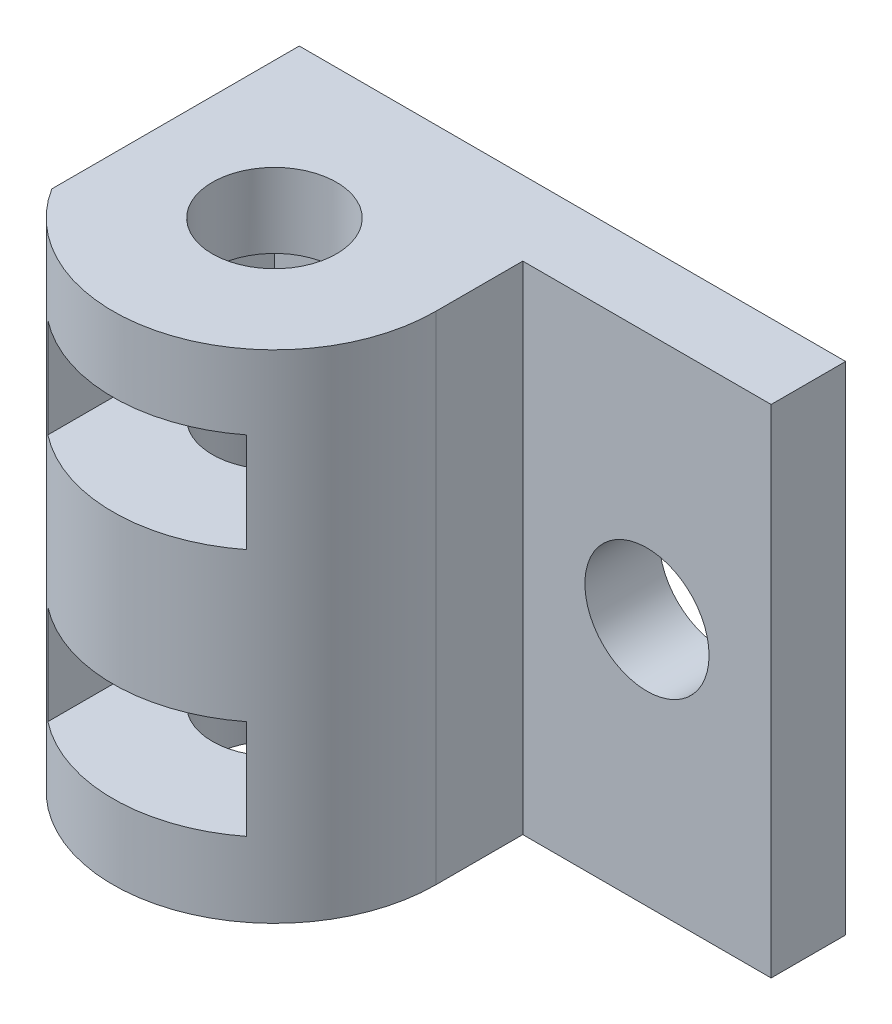
ISO-10303-21;
HEADER;
FILE_DESCRIPTION(('STEP AP214'),'2;1');
FILE_NAME('part.step','',(''),(''),'','','');
FILE_SCHEMA(('AUTOMOTIVE_DESIGN { 1 0 10303 214 1 1 1 1 }'));
ENDSEC;
DATA;
#1=APPLICATION_CONTEXT('core data for automotive mechanical design processes');
#2=APPLICATION_PROTOCOL_DEFINITION('international standard','automotive_design',2000,#1);
#3=PRODUCT_CONTEXT('',#1,'mechanical');
#4=PRODUCT('Part','Part','',(#3));
#5=PRODUCT_RELATED_PRODUCT_CATEGORY('part','',(#4));
#6=PRODUCT_DEFINITION_FORMATION('','',#4);
#7=PRODUCT_DEFINITION_CONTEXT('part definition',#1,'design');
#8=PRODUCT_DEFINITION('design','',#6,#7);
#9=PRODUCT_DEFINITION_SHAPE('','',#8);
#10=(LENGTH_UNIT() NAMED_UNIT(*) SI_UNIT(.MILLI.,.METRE.));
#11=(NAMED_UNIT(*) PLANE_ANGLE_UNIT() SI_UNIT($,.RADIAN.));
#12=(NAMED_UNIT(*) SI_UNIT($,.STERADIAN.) SOLID_ANGLE_UNIT());
#13=UNCERTAINTY_MEASURE_WITH_UNIT(LENGTH_MEASURE(1.E-05),#10,'distance_accuracy_value','');
#14=(GEOMETRIC_REPRESENTATION_CONTEXT(3) GLOBAL_UNCERTAINTY_ASSIGNED_CONTEXT((#13)) GLOBAL_UNIT_ASSIGNED_CONTEXT((#10,
#11,#12)) REPRESENTATION_CONTEXT('',''));
#15=CARTESIAN_POINT('',(0.,0.,0.));
#16=DIRECTION('',(0.,0.,1.));
#17=DIRECTION('',(1.,0.,0.));
#18=AXIS2_PLACEMENT_3D('',#15,#16,#17);
#19=CARTESIAN_POINT('',(-4.05947955390334,-14.7630111524164,6.5));
#20=DIRECTION('',(0.,1.,0.));
#21=DIRECTION('',(0.,0.,1.));
#22=AXIS2_PLACEMENT_3D('',#19,#20,#21);
#23=CYLINDRICAL_SURFACE('',#22,6.5);
#24=DIRECTION('',(0.,1.,0.));
#25=VECTOR('',#24,1.);
#26=CARTESIAN_POINT('',(-9.55947955390334,-14.7630111524164,9.96410161513776));
#27=LINE('',#26,#25);
#28=CARTESIAN_POINT('',(-9.55947955390334,-14.7630111524164,9.96410161513776));
#29=VERTEX_POINT('',#28);
#30=CARTESIAN_POINT('',(-9.55947955390334,5.23698884758364,9.96410161513776));
#31=VERTEX_POINT('',#30);
#32=EDGE_CURVE('E150',#29,#31,#27,.T.);
#33=ORIENTED_EDGE('',*,*,#32,.F.);
#34=CARTESIAN_POINT('',(-4.05947955390334,-14.7630111524164,6.5));
#35=DIRECTION('',(0.,1.,0.));
#36=DIRECTION('',(0.,0.,1.));
#37=AXIS2_PLACEMENT_3D('',#34,#35,#36);
#38=CIRCLE('',#37,6.5);
#39=CARTESIAN_POINT('',(2.44052044609666,-14.7630111524164,6.5));
#40=VERTEX_POINT('',#39);
#41=EDGE_CURVE('E159',#29,#40,#38,.T.);
#42=ORIENTED_EDGE('',*,*,#41,.T.);
#43=DIRECTION('',(0.,1.,0.));
#44=VECTOR('',#43,1.);
#45=CARTESIAN_POINT('',(2.44052044609666,-14.7630111524164,6.5));
#46=LINE('',#45,#44);
#47=CARTESIAN_POINT('',(2.44052044609666,5.23698884758364,6.5));
#48=VERTEX_POINT('',#47);
#49=EDGE_CURVE('E173',#40,#48,#46,.T.);
#50=ORIENTED_EDGE('',*,*,#49,.T.);
#51=CARTESIAN_POINT('',(-4.05947955390334,5.23698884758364,6.5));
#52=DIRECTION('',(0.,1.,0.));
#53=DIRECTION('',(0.,0.,1.));
#54=AXIS2_PLACEMENT_3D('',#51,#52,#53);
#55=CIRCLE('',#54,6.5);
#56=EDGE_CURVE('E295',#31,#48,#55,.T.);
#57=ORIENTED_EDGE('',*,*,#56,.F.);
#58=EDGE_LOOP('',(#33,#42,#50,#57));
#59=FACE_BOUND('',#58,.T.);
#60=DIRECTION('',(0.,1.,0.));
#61=VECTOR('',#60,1.);
#62=CARTESIAN_POINT('',(-8.05947955390335,-14.7630111524164,11.6234753829798));
#63=LINE('',#62,#61);
#64=CARTESIAN_POINT('',(-8.05947955390335,-1.76301115241636,11.6234753829798));
#65=VERTEX_POINT('',#64);
#66=CARTESIAN_POINT('',(-8.05947955390334,2.23698884758364,11.6234753829798));
#67=VERTEX_POINT('',#66);
#68=EDGE_CURVE('E189',#65,#67,#63,.T.);
#69=ORIENTED_EDGE('',*,*,#68,.T.);
#70=CARTESIAN_POINT('',(-4.05947955390334,2.23698884758364,6.5));
#71=DIRECTION('',(0.,-1.,0.));
#72=DIRECTION('',(0.,0.,-1.));
#73=AXIS2_PLACEMENT_3D('',#70,#71,#72);
#74=CIRCLE('',#73,6.5);
#75=CARTESIAN_POINT('',(-0.0594795539033436,2.23698884758364,11.6234753829798));
#76=VERTEX_POINT('',#75);
#77=EDGE_CURVE('E200',#67,#76,#74,.F.);
#78=ORIENTED_EDGE('',*,*,#77,.T.);
#79=DIRECTION('',(0.,1.,0.));
#80=VECTOR('',#79,1.);
#81=CARTESIAN_POINT('',(-0.0594795539033443,-14.7630111524164,11.6234753829798));
#82=LINE('',#81,#80);
#83=CARTESIAN_POINT('',(-0.0594795539033443,-1.76301115241636,11.6234753829798));
#84=VERTEX_POINT('',#83);
#85=EDGE_CURVE('E204',#84,#76,#82,.T.);
#86=ORIENTED_EDGE('',*,*,#85,.F.);
#87=CARTESIAN_POINT('',(-4.05947955390334,-1.76301115241636,6.5));
#88=DIRECTION('',(0.,-1.,0.));
#89=DIRECTION('',(0.,0.,-1.));
#90=AXIS2_PLACEMENT_3D('',#87,#88,#89);
#91=CIRCLE('',#90,6.5);
#92=EDGE_CURVE('E194',#65,#84,#91,.F.);
#93=ORIENTED_EDGE('',*,*,#92,.F.);
#94=EDGE_LOOP('',(#69,#78,#86,#93));
#95=FACE_BOUND('',#94,.T.);
#96=DIRECTION('',(0.,1.,0.));
#97=VECTOR('',#96,1.);
#98=CARTESIAN_POINT('',(-8.05947955390334,-14.7630111524164,11.6234753829798));
#99=LINE('',#98,#97);
#100=CARTESIAN_POINT('',(-8.05947955390334,-11.7630111524164,11.6234753829798));
#101=VERTEX_POINT('',#100);
#102=CARTESIAN_POINT('',(-8.05947955390334,-7.76301115241636,11.6234753829798));
#103=VERTEX_POINT('',#102);
#104=EDGE_CURVE('E51',#101,#103,#99,.T.);
#105=ORIENTED_EDGE('',*,*,#104,.T.);
#106=CARTESIAN_POINT('',(-4.05947955390334,-7.76301115241636,6.5));
#107=DIRECTION('',(0.,-1.,0.));
#108=DIRECTION('',(0.,0.,-1.));
#109=AXIS2_PLACEMENT_3D('',#106,#107,#108);
#110=CIRCLE('',#109,6.5);
#111=CARTESIAN_POINT('',(-0.0594795539033428,-7.76301115241636,11.6234753829798));
#112=VERTEX_POINT('',#111);
#113=EDGE_CURVE('E217',#103,#112,#110,.F.);
#114=ORIENTED_EDGE('',*,*,#113,.T.);
#115=DIRECTION('',(0.,1.,0.));
#116=VECTOR('',#115,1.);
#117=CARTESIAN_POINT('',(-0.0594795539033434,-14.7630111524164,11.6234753829798));
#118=LINE('',#117,#116);
#119=CARTESIAN_POINT('',(-0.0594795539033434,-11.7630111524164,11.6234753829798));
#120=VERTEX_POINT('',#119);
#121=EDGE_CURVE('E11',#120,#112,#118,.T.);
#122=ORIENTED_EDGE('',*,*,#121,.F.);
#123=CARTESIAN_POINT('',(-4.05947955390334,-11.7630111524164,6.5));
#124=DIRECTION('',(0.,-1.,0.));
#125=DIRECTION('',(0.,0.,-1.));
#126=AXIS2_PLACEMENT_3D('',#123,#124,#125);
#127=CIRCLE('',#126,6.5);
#128=EDGE_CURVE('E211',#101,#120,#127,.F.);
#129=ORIENTED_EDGE('',*,*,#128,.F.);
#130=EDGE_LOOP('',(#105,#114,#122,#129));
#131=FACE_BOUND('',#130,.T.);
#132=ADVANCED_FACE('F41',(#59,#95,#131),#23,.T.);
#133=CARTESIAN_POINT('',(-4.05947955390334,-14.7630111524164,6.5));
#134=DIRECTION('',(0.,1.,0.));
#135=DIRECTION('',(0.,0.,1.));
#136=AXIS2_PLACEMENT_3D('',#133,#134,#135);
#137=CYLINDRICAL_SURFACE('',#136,2.5);
#138=CARTESIAN_POINT('',(-4.05947955390334,-1.76301115241636,6.5));
#139=DIRECTION('',(0.,-1.,0.));
#140=DIRECTION('',(0.,0.,-1.));
#141=AXIS2_PLACEMENT_3D('',#138,#139,#140);
#142=CIRCLE('',#141,2.5);
#143=CARTESIAN_POINT('',(-4.05947955390334,-1.76301115241636,4.));
#144=VERTEX_POINT('',#143);
#145=EDGE_CURVE('E190',#144,#144,#142,.F.);
#146=ORIENTED_EDGE('',*,*,#145,.T.);
#147=EDGE_LOOP('',(#146));
#148=FACE_BOUND('',#147,.T.);
#149=CARTESIAN_POINT('',(-4.05947955390334,-7.76301115241636,6.5));
#150=DIRECTION('',(0.,-1.,0.));
#151=DIRECTION('',(0.,0.,-1.));
#152=AXIS2_PLACEMENT_3D('',#149,#150,#151);
#153=CIRCLE('',#152,2.5);
#154=CARTESIAN_POINT('',(-4.05947955390334,-7.76301115241636,4.));
#155=VERTEX_POINT('',#154);
#156=EDGE_CURVE('E213',#155,#155,#153,.F.);
#157=ORIENTED_EDGE('',*,*,#156,.F.);
#158=EDGE_LOOP('',(#157));
#159=FACE_BOUND('',#158,.T.);
#160=ADVANCED_FACE('F349',(#148,#159),#137,.F.);
#161=CARTESIAN_POINT('',(-4.05947955390334,5.23698884758364,6.5));
#162=DIRECTION('',(0.,1.,0.));
#163=DIRECTION('',(0.,0.,1.));
#164=AXIS2_PLACEMENT_3D('',#161,#162,#163);
#165=CIRCLE('',#164,2.5);
#166=CARTESIAN_POINT('',(-4.05947955390334,5.23698884758364,9.));
#167=VERTEX_POINT('',#166);
#168=EDGE_CURVE('E299',#167,#167,#165,.T.);
#169=ORIENTED_EDGE('',*,*,#168,.T.);
#170=EDGE_LOOP('',(#169));
#171=FACE_BOUND('',#170,.T.);
#172=CARTESIAN_POINT('',(-4.05947955390334,2.23698884758364,6.5));
#173=DIRECTION('',(0.,-1.,0.));
#174=DIRECTION('',(0.,0.,-1.));
#175=AXIS2_PLACEMENT_3D('',#172,#173,#174);
#176=CIRCLE('',#175,2.5);
#177=CARTESIAN_POINT('',(-4.05947955390334,2.23698884758364,4.));
#178=VERTEX_POINT('',#177);
#179=EDGE_CURVE('E196',#178,#178,#176,.F.);
#180=ORIENTED_EDGE('',*,*,#179,.F.);
#181=EDGE_LOOP('',(#180));
#182=FACE_BOUND('',#181,.T.);
#183=ADVANCED_FACE('F347',(#171,#182),#137,.F.);
#184=CARTESIAN_POINT('',(-10.5594795539033,-14.7630111524164,3.));
#185=DIRECTION('',(0.,1.,0.));
#186=DIRECTION('',(0.,0.,1.));
#187=AXIS2_PLACEMENT_3D('',#184,#185,#186);
#188=PLANE('',#187);
#189=ORIENTED_EDGE('',*,*,#41,.F.);
#190=DIRECTION('',(0.,0.,1.));
#191=VECTOR('',#190,1.);
#192=CARTESIAN_POINT('',(-9.55947955390334,-14.7630111524164,0.));
#193=LINE('',#192,#191);
#194=CARTESIAN_POINT('',(-9.55947955390334,-14.7630111524164,0.));
#195=VERTEX_POINT('',#194);
#196=EDGE_CURVE('E143',#195,#29,#193,.T.);
#197=ORIENTED_EDGE('',*,*,#196,.F.);
#198=DIRECTION('',(1.,0.,0.));
#199=VECTOR('',#198,1.);
#200=CARTESIAN_POINT('',(-10.5594795539033,-14.7630111524164,0.));
#201=LINE('',#200,#199);
#202=CARTESIAN_POINT('',(12.4405204460967,-14.7630111524164,0.));
#203=VERTEX_POINT('',#202);
#204=EDGE_CURVE('E156',#195,#203,#201,.T.);
#205=ORIENTED_EDGE('',*,*,#204,.T.);
#206=DIRECTION('',(0.,0.,-1.));
#207=VECTOR('',#206,1.);
#208=CARTESIAN_POINT('',(12.4405204460967,-14.7630111524164,3.));
#209=LINE('',#208,#207);
#210=CARTESIAN_POINT('',(12.4405204460967,-14.7630111524164,3.));
#211=VERTEX_POINT('',#210);
#212=EDGE_CURVE('E186',#211,#203,#209,.T.);
#213=ORIENTED_EDGE('',*,*,#212,.F.);
#214=DIRECTION('',(1.,0.,0.));
#215=VECTOR('',#214,1.);
#216=CARTESIAN_POINT('',(-10.5594795539033,-14.7630111524164,3.));
#217=LINE('',#216,#215);
#218=CARTESIAN_POINT('',(2.44052044609666,-14.7630111524164,3.));
#219=VERTEX_POINT('',#218);
#220=EDGE_CURVE('E181',#219,#211,#217,.T.);
#221=ORIENTED_EDGE('',*,*,#220,.F.);
#222=DIRECTION('',(0.,0.,-1.));
#223=VECTOR('',#222,1.);
#224=CARTESIAN_POINT('',(2.44052044609666,-14.7630111524164,0.));
#225=LINE('',#224,#223);
#226=EDGE_CURVE('E298',#40,#219,#225,.T.);
#227=ORIENTED_EDGE('',*,*,#226,.F.);
#228=EDGE_LOOP('',(#189,#197,#205,#213,#221,#227));
#229=FACE_BOUND('',#228,.T.);
#230=CARTESIAN_POINT('',(-4.05947955390334,-14.7630111524164,6.5));
#231=DIRECTION('',(0.,1.,0.));
#232=DIRECTION('',(0.,0.,1.));
#233=AXIS2_PLACEMENT_3D('',#230,#231,#232);
#234=CIRCLE('',#233,2.5);
#235=CARTESIAN_POINT('',(-4.05947955390334,-14.7630111524164,9.));
#236=VERTEX_POINT('',#235);
#237=EDGE_CURVE('E303',#236,#236,#234,.T.);
#238=ORIENTED_EDGE('',*,*,#237,.T.);
#239=EDGE_LOOP('',(#238));
#240=FACE_BOUND('',#239,.T.);
#241=ADVANCED_FACE('F43',(#229,#240),#188,.F.);
#242=CARTESIAN_POINT('',(12.4405204460967,5.23698884758364,3.));
#243=DIRECTION('',(-1.,0.,0.));
#244=DIRECTION('',(0.,-1.,0.));
#245=AXIS2_PLACEMENT_3D('',#242,#243,#244);
#246=PLANE('',#245);
#247=DIRECTION('',(0.,1.,0.));
#248=VECTOR('',#247,1.);
#249=CARTESIAN_POINT('',(12.4405204460967,5.23698884758364,0.));
#250=LINE('',#249,#248);
#251=CARTESIAN_POINT('',(12.4405204460967,5.23698884758364,0.));
#252=VERTEX_POINT('',#251);
#253=EDGE_CURVE('E164',#203,#252,#250,.T.);
#254=ORIENTED_EDGE('',*,*,#253,.T.);
#255=DIRECTION('',(0.,0.,-1.));
#256=VECTOR('',#255,1.);
#257=CARTESIAN_POINT('',(12.4405204460967,5.23698884758364,3.));
#258=LINE('',#257,#256);
#259=CARTESIAN_POINT('',(12.4405204460967,5.23698884758364,3.));
#260=VERTEX_POINT('',#259);
#261=EDGE_CURVE('E182',#260,#252,#258,.T.);
#262=ORIENTED_EDGE('',*,*,#261,.F.);
#263=DIRECTION('',(0.,1.,0.));
#264=VECTOR('',#263,1.);
#265=CARTESIAN_POINT('',(12.4405204460967,5.23698884758364,3.));
#266=LINE('',#265,#264);
#267=EDGE_CURVE('E320',#211,#260,#266,.T.);
#268=ORIENTED_EDGE('',*,*,#267,.F.);
#269=ORIENTED_EDGE('',*,*,#212,.T.);
#270=EDGE_LOOP('',(#254,#262,#268,#269));
#271=FACE_BOUND('',#270,.T.);
#272=ADVANCED_FACE('F340',(#271),#246,.F.);
#273=CARTESIAN_POINT('',(-10.5594795539033,5.23698884758364,3.));
#274=DIRECTION('',(0.,-1.,0.));
#275=DIRECTION('',(0.,0.,-1.));
#276=AXIS2_PLACEMENT_3D('',#273,#274,#275);
#277=PLANE('',#276);
#278=DIRECTION('',(-1.,0.,0.));
#279=VECTOR('',#278,1.);
#280=CARTESIAN_POINT('',(-10.5594795539033,5.23698884758364,0.));
#281=LINE('',#280,#279);
#282=CARTESIAN_POINT('',(-9.55947955390334,5.23698884758364,0.));
#283=VERTEX_POINT('',#282);
#284=EDGE_CURVE('E170',#252,#283,#281,.T.);
#285=ORIENTED_EDGE('',*,*,#284,.T.);
#286=DIRECTION('',(0.,0.,1.));
#287=VECTOR('',#286,1.);
#288=CARTESIAN_POINT('',(-9.55947955390334,5.23698884758364,0.));
#289=LINE('',#288,#287);
#290=EDGE_CURVE('E58',#283,#31,#289,.T.);
#291=ORIENTED_EDGE('',*,*,#290,.T.);
#292=ORIENTED_EDGE('',*,*,#56,.T.);
#293=DIRECTION('',(0.,0.,-1.));
#294=VECTOR('',#293,1.);
#295=CARTESIAN_POINT('',(2.44052044609666,5.23698884758364,0.));
#296=LINE('',#295,#294);
#297=CARTESIAN_POINT('',(2.44052044609666,5.23698884758364,3.));
#298=VERTEX_POINT('',#297);
#299=EDGE_CURVE('E309',#48,#298,#296,.T.);
#300=ORIENTED_EDGE('',*,*,#299,.T.);
#301=DIRECTION('',(-1.,0.,0.));
#302=VECTOR('',#301,1.);
#303=CARTESIAN_POINT('',(-10.5594795539033,5.23698884758364,3.));
#304=LINE('',#303,#302);
#305=EDGE_CURVE('E176',#260,#298,#304,.T.);
#306=ORIENTED_EDGE('',*,*,#305,.F.);
#307=ORIENTED_EDGE('',*,*,#261,.T.);
#308=EDGE_LOOP('',(#285,#291,#292,#300,#306,#307));
#309=FACE_BOUND('',#308,.T.);
#310=ORIENTED_EDGE('',*,*,#168,.F.);
#311=EDGE_LOOP('',(#310));
#312=FACE_BOUND('',#311,.T.);
#313=ADVANCED_FACE('F334',(#309,#312),#277,.F.);
#314=CARTESIAN_POINT('',(0.,0.,3.));
#315=DIRECTION('',(0.,0.,1.));
#316=DIRECTION('',(1.,0.,0.));
#317=AXIS2_PLACEMENT_3D('',#314,#315,#316);
#318=PLANE('',#317);
#319=CARTESIAN_POINT('',(7.44052044609666,-4.76301115241636,3.));
#320=DIRECTION('',(0.,0.,1.));
#321=DIRECTION('',(1.,0.,0.));
#322=AXIS2_PLACEMENT_3D('',#319,#320,#321);
#323=CIRCLE('',#322,2.5);
#324=CARTESIAN_POINT('',(9.94052044609666,-4.76301115241636,3.));
#325=VERTEX_POINT('',#324);
#326=EDGE_CURVE('E371',#325,#325,#323,.T.);
#327=ORIENTED_EDGE('',*,*,#326,.F.);
#328=EDGE_LOOP('',(#327));
#329=FACE_BOUND('',#328,.T.);
#330=DIRECTION('',(0.,1.,0.));
#331=VECTOR('',#330,1.);
#332=CARTESIAN_POINT('',(2.44052044609666,-14.7630111524164,3.));
#333=LINE('',#332,#331);
#334=EDGE_CURVE('E166',#219,#298,#333,.T.);
#335=ORIENTED_EDGE('',*,*,#334,.F.);
#336=ORIENTED_EDGE('',*,*,#220,.T.);
#337=ORIENTED_EDGE('',*,*,#267,.T.);
#338=ORIENTED_EDGE('',*,*,#305,.T.);
#339=EDGE_LOOP('',(#335,#336,#337,#338));
#340=FACE_BOUND('',#339,.T.);
#341=ADVANCED_FACE('F327',(#329,#340),#318,.T.);
#342=CARTESIAN_POINT('',(0.,0.,0.));
#343=DIRECTION('',(0.,0.,1.));
#344=DIRECTION('',(1.,0.,0.));
#345=AXIS2_PLACEMENT_3D('',#342,#343,#344);
#346=PLANE('',#345);
#347=CARTESIAN_POINT('',(7.44052044609666,-4.76301115241636,0.));
#348=DIRECTION('',(0.,0.,1.));
#349=DIRECTION('',(1.,0.,0.));
#350=AXIS2_PLACEMENT_3D('',#347,#348,#349);
#351=CIRCLE('',#350,2.5);
#352=CARTESIAN_POINT('',(9.94052044609666,-4.76301115241636,0.));
#353=VERTEX_POINT('',#352);
#354=EDGE_CURVE('E45',#353,#353,#351,.T.);
#355=ORIENTED_EDGE('',*,*,#354,.T.);
#356=EDGE_LOOP('',(#355));
#357=FACE_BOUND('',#356,.T.);
#358=ORIENTED_EDGE('',*,*,#204,.F.);
#359=DIRECTION('',(0.,-1.,0.));
#360=VECTOR('',#359,1.);
#361=CARTESIAN_POINT('',(-9.55947955390334,5.23698884758364,0.));
#362=LINE('',#361,#360);
#363=EDGE_CURVE('E140',#283,#195,#362,.T.);
#364=ORIENTED_EDGE('',*,*,#363,.F.);
#365=ORIENTED_EDGE('',*,*,#284,.F.);
#366=ORIENTED_EDGE('',*,*,#253,.F.);
#367=EDGE_LOOP('',(#358,#364,#365,#366));
#368=FACE_BOUND('',#367,.T.);
#369=ADVANCED_FACE('F163',(#357,#368),#346,.F.);
#370=CARTESIAN_POINT('',(2.44052044609666,-14.7630111524164,0.));
#371=DIRECTION('',(1.,0.,0.));
#372=DIRECTION('',(0.,0.,-1.));
#373=AXIS2_PLACEMENT_3D('',#370,#371,#372);
#374=PLANE('',#373);
#375=ORIENTED_EDGE('',*,*,#299,.F.);
#376=ORIENTED_EDGE('',*,*,#49,.F.);
#377=ORIENTED_EDGE('',*,*,#226,.T.);
#378=ORIENTED_EDGE('',*,*,#334,.T.);
#379=EDGE_LOOP('',(#375,#376,#377,#378));
#380=FACE_BOUND('',#379,.T.);
#381=ADVANCED_FACE('F332',(#380),#374,.T.);
#382=CARTESIAN_POINT('',(-4.05947955390334,-11.7630111524164,6.5));
#383=DIRECTION('',(0.,-1.,0.));
#384=DIRECTION('',(0.,0.,-1.));
#385=AXIS2_PLACEMENT_3D('',#382,#383,#384);
#386=CIRCLE('',#385,2.5);
#387=CARTESIAN_POINT('',(-4.05947955390334,-11.7630111524164,4.));
#388=VERTEX_POINT('',#387);
#389=EDGE_CURVE('E207',#388,#388,#386,.F.);
#390=ORIENTED_EDGE('',*,*,#389,.T.);
#391=EDGE_LOOP('',(#390));
#392=FACE_BOUND('',#391,.T.);
#393=ORIENTED_EDGE('',*,*,#237,.F.);
#394=EDGE_LOOP('',(#393));
#395=FACE_BOUND('',#394,.T.);
#396=ADVANCED_FACE('F356',(#392,#395),#137,.F.);
#397=CARTESIAN_POINT('',(0.,2.23698884758364,0.));
#398=DIRECTION('',(0.,-1.,0.));
#399=DIRECTION('',(0.,0.,-1.));
#400=AXIS2_PLACEMENT_3D('',#397,#398,#399);
#401=PLANE('',#400);
#402=DIRECTION('',(0.,0.,1.));
#403=VECTOR('',#402,1.);
#404=CARTESIAN_POINT('',(-8.05947955390334,2.23698884758364,10.5));
#405=LINE('',#404,#403);
#406=CARTESIAN_POINT('',(-8.05947955390334,2.23698884758364,2.5));
#407=VERTEX_POINT('',#406);
#408=EDGE_CURVE('E267',#407,#67,#405,.T.);
#409=ORIENTED_EDGE('',*,*,#408,.F.);
#410=DIRECTION('',(-1.,0.,0.));
#411=VECTOR('',#410,1.);
#412=CARTESIAN_POINT('',(-0.0594795539033428,2.23698884758364,2.5));
#413=LINE('',#412,#411);
#414=CARTESIAN_POINT('',(-0.0594795539033428,2.23698884758364,2.5));
#415=VERTEX_POINT('',#414);
#416=EDGE_CURVE('E272',#415,#407,#413,.T.);
#417=ORIENTED_EDGE('',*,*,#416,.F.);
#418=DIRECTION('',(0.,0.,1.));
#419=VECTOR('',#418,1.);
#420=CARTESIAN_POINT('',(-0.0594795539033437,2.23698884758364,10.5));
#421=LINE('',#420,#419);
#422=EDGE_CURVE('E263',#415,#76,#421,.T.);
#423=ORIENTED_EDGE('',*,*,#422,.T.);
#424=ORIENTED_EDGE('',*,*,#77,.F.);
#425=EDGE_LOOP('',(#409,#417,#423,#424));
#426=FACE_BOUND('',#425,.T.);
#427=ORIENTED_EDGE('',*,*,#179,.T.);
#428=EDGE_LOOP('',(#427));
#429=FACE_BOUND('',#428,.T.);
#430=ADVANCED_FACE('F405',(#426,#429),#401,.T.);
#431=CARTESIAN_POINT('',(0.,-1.76301115241636,0.));
#432=DIRECTION('',(0.,-1.,0.));
#433=DIRECTION('',(0.,0.,-1.));
#434=AXIS2_PLACEMENT_3D('',#431,#432,#433);
#435=PLANE('',#434);
#436=ORIENTED_EDGE('',*,*,#92,.T.);
#437=DIRECTION('',(0.,0.,1.));
#438=VECTOR('',#437,1.);
#439=CARTESIAN_POINT('',(-0.0594795539033428,-1.76301115241636,2.5));
#440=LINE('',#439,#438);
#441=CARTESIAN_POINT('',(-0.0594795539033428,-1.76301115241636,2.5));
#442=VERTEX_POINT('',#441);
#443=EDGE_CURVE('E268',#442,#84,#440,.T.);
#444=ORIENTED_EDGE('',*,*,#443,.F.);
#445=DIRECTION('',(-1.,0.,0.));
#446=VECTOR('',#445,1.);
#447=CARTESIAN_POINT('',(-0.0594795539033428,-1.76301115241636,2.5));
#448=LINE('',#447,#446);
#449=CARTESIAN_POINT('',(-8.05947955390334,-1.76301115241636,2.5));
#450=VERTEX_POINT('',#449);
#451=EDGE_CURVE('E279',#442,#450,#448,.T.);
#452=ORIENTED_EDGE('',*,*,#451,.T.);
#453=DIRECTION('',(0.,0.,1.));
#454=VECTOR('',#453,1.);
#455=CARTESIAN_POINT('',(-8.05947955390334,-1.76301115241636,2.5));
#456=LINE('',#455,#454);
#457=EDGE_CURVE('E262',#450,#65,#456,.T.);
#458=ORIENTED_EDGE('',*,*,#457,.T.);
#459=EDGE_LOOP('',(#436,#444,#452,#458));
#460=FACE_BOUND('',#459,.T.);
#461=ORIENTED_EDGE('',*,*,#145,.F.);
#462=EDGE_LOOP('',(#461));
#463=FACE_BOUND('',#462,.T.);
#464=ADVANCED_FACE('F408',(#460,#463),#435,.F.);
#465=CARTESIAN_POINT('',(-0.0594795539033428,2.23698884758364,2.5));
#466=DIRECTION('',(1.,0.,0.));
#467=DIRECTION('',(0.,0.,-1.));
#468=AXIS2_PLACEMENT_3D('',#465,#466,#467);
#469=PLANE('',#468);
#470=ORIENTED_EDGE('',*,*,#85,.T.);
#471=ORIENTED_EDGE('',*,*,#422,.F.);
#472=DIRECTION('',(0.,-1.,0.));
#473=VECTOR('',#472,1.);
#474=CARTESIAN_POINT('',(-0.0594795539033428,2.23698884758364,2.5));
#475=LINE('',#474,#473);
#476=EDGE_CURVE('E195',#415,#442,#475,.T.);
#477=ORIENTED_EDGE('',*,*,#476,.T.);
#478=ORIENTED_EDGE('',*,*,#443,.T.);
#479=EDGE_LOOP('',(#470,#471,#477,#478));
#480=FACE_BOUND('',#479,.T.);
#481=ADVANCED_FACE('F412',(#480),#469,.F.);
#482=CARTESIAN_POINT('',(-0.0594795539033428,2.23698884758364,2.5));
#483=DIRECTION('',(0.,0.,1.));
#484=DIRECTION('',(1.,0.,0.));
#485=AXIS2_PLACEMENT_3D('',#482,#483,#484);
#486=PLANE('',#485);
#487=ORIENTED_EDGE('',*,*,#451,.F.);
#488=ORIENTED_EDGE('',*,*,#476,.F.);
#489=ORIENTED_EDGE('',*,*,#416,.T.);
#490=DIRECTION('',(0.,-1.,0.));
#491=VECTOR('',#490,1.);
#492=CARTESIAN_POINT('',(-8.05947955390334,2.23698884758364,2.5));
#493=LINE('',#492,#491);
#494=EDGE_CURVE('E276',#407,#450,#493,.T.);
#495=ORIENTED_EDGE('',*,*,#494,.T.);
#496=EDGE_LOOP('',(#487,#488,#489,#495));
#497=FACE_BOUND('',#496,.T.);
#498=ADVANCED_FACE('F416',(#497),#486,.T.);
#499=CARTESIAN_POINT('',(-8.05947955390334,2.23698884758364,2.5));
#500=DIRECTION('',(1.,0.,0.));
#501=DIRECTION('',(0.,0.,-1.));
#502=AXIS2_PLACEMENT_3D('',#499,#500,#501);
#503=PLANE('',#502);
#504=ORIENTED_EDGE('',*,*,#457,.F.);
#505=ORIENTED_EDGE('',*,*,#494,.F.);
#506=ORIENTED_EDGE('',*,*,#408,.T.);
#507=ORIENTED_EDGE('',*,*,#68,.F.);
#508=EDGE_LOOP('',(#504,#505,#506,#507));
#509=FACE_BOUND('',#508,.T.);
#510=ADVANCED_FACE('F395',(#509),#503,.T.);
#511=CARTESIAN_POINT('',(0.,-7.76301115241636,0.));
#512=DIRECTION('',(0.,-1.,0.));
#513=DIRECTION('',(0.,0.,-1.));
#514=AXIS2_PLACEMENT_3D('',#511,#512,#513);
#515=PLANE('',#514);
#516=DIRECTION('',(0.,0.,1.));
#517=VECTOR('',#516,1.);
#518=CARTESIAN_POINT('',(-8.05947955390334,-7.76301115241636,10.5));
#519=LINE('',#518,#517);
#520=CARTESIAN_POINT('',(-8.05947955390334,-7.76301115241636,2.5));
#521=VERTEX_POINT('',#520);
#522=EDGE_CURVE('E228',#521,#103,#519,.T.);
#523=ORIENTED_EDGE('',*,*,#522,.F.);
#524=DIRECTION('',(-1.,0.,0.));
#525=VECTOR('',#524,1.);
#526=CARTESIAN_POINT('',(-0.0594795539033419,-7.76301115241636,2.5));
#527=LINE('',#526,#525);
#528=CARTESIAN_POINT('',(-0.0594795539033419,-7.76301115241636,2.5));
#529=VERTEX_POINT('',#528);
#530=EDGE_CURVE('E235',#529,#521,#527,.T.);
#531=ORIENTED_EDGE('',*,*,#530,.F.);
#532=DIRECTION('',(0.,0.,1.));
#533=VECTOR('',#532,1.);
#534=CARTESIAN_POINT('',(-0.0594795539033429,-7.76301115241636,10.5));
#535=LINE('',#534,#533);
#536=EDGE_CURVE('E236',#529,#112,#535,.T.);
#537=ORIENTED_EDGE('',*,*,#536,.T.);
#538=ORIENTED_EDGE('',*,*,#113,.F.);
#539=EDGE_LOOP('',(#523,#531,#537,#538));
#540=FACE_BOUND('',#539,.T.);
#541=ORIENTED_EDGE('',*,*,#156,.T.);
#542=EDGE_LOOP('',(#541));
#543=FACE_BOUND('',#542,.T.);
#544=ADVANCED_FACE('F391',(#540,#543),#515,.T.);
#545=CARTESIAN_POINT('',(0.,-11.7630111524164,0.));
#546=DIRECTION('',(0.,-1.,0.));
#547=DIRECTION('',(0.,0.,-1.));
#548=AXIS2_PLACEMENT_3D('',#545,#546,#547);
#549=PLANE('',#548);
#550=ORIENTED_EDGE('',*,*,#128,.T.);
#551=DIRECTION('',(0.,0.,1.));
#552=VECTOR('',#551,1.);
#553=CARTESIAN_POINT('',(-0.0594795539033419,-11.7630111524164,2.5));
#554=LINE('',#553,#552);
#555=CARTESIAN_POINT('',(-0.0594795539033419,-11.7630111524164,2.5));
#556=VERTEX_POINT('',#555);
#557=EDGE_CURVE('E242',#556,#120,#554,.T.);
#558=ORIENTED_EDGE('',*,*,#557,.F.);
#559=DIRECTION('',(-1.,0.,0.));
#560=VECTOR('',#559,1.);
#561=CARTESIAN_POINT('',(-0.0594795539033419,-11.7630111524164,2.5));
#562=LINE('',#561,#560);
#563=CARTESIAN_POINT('',(-8.05947955390334,-11.7630111524164,2.5));
#564=VERTEX_POINT('',#563);
#565=EDGE_CURVE('E248',#556,#564,#562,.T.);
#566=ORIENTED_EDGE('',*,*,#565,.T.);
#567=DIRECTION('',(0.,0.,1.));
#568=VECTOR('',#567,1.);
#569=CARTESIAN_POINT('',(-8.05947955390334,-11.7630111524164,2.5));
#570=LINE('',#569,#568);
#571=EDGE_CURVE('E66',#564,#101,#570,.T.);
#572=ORIENTED_EDGE('',*,*,#571,.T.);
#573=EDGE_LOOP('',(#550,#558,#566,#572));
#574=FACE_BOUND('',#573,.T.);
#575=ORIENTED_EDGE('',*,*,#389,.F.);
#576=EDGE_LOOP('',(#575));
#577=FACE_BOUND('',#576,.T.);
#578=ADVANCED_FACE('F394',(#574,#577),#549,.F.);
#579=CARTESIAN_POINT('',(-0.0594795539033419,-7.76301115241636,2.5));
#580=DIRECTION('',(1.,0.,0.));
#581=DIRECTION('',(0.,0.,-1.));
#582=AXIS2_PLACEMENT_3D('',#579,#580,#581);
#583=PLANE('',#582);
#584=ORIENTED_EDGE('',*,*,#121,.T.);
#585=ORIENTED_EDGE('',*,*,#536,.F.);
#586=DIRECTION('',(0.,-1.,0.));
#587=VECTOR('',#586,1.);
#588=CARTESIAN_POINT('',(-0.0594795539033419,-7.76301115241636,2.5));
#589=LINE('',#588,#587);
#590=EDGE_CURVE('E212',#529,#556,#589,.T.);
#591=ORIENTED_EDGE('',*,*,#590,.T.);
#592=ORIENTED_EDGE('',*,*,#557,.T.);
#593=EDGE_LOOP('',(#584,#585,#591,#592));
#594=FACE_BOUND('',#593,.T.);
#595=ADVANCED_FACE('F398',(#594),#583,.F.);
#596=CARTESIAN_POINT('',(-0.0594795539033419,-7.76301115241636,2.5));
#597=DIRECTION('',(0.,0.,1.));
#598=DIRECTION('',(1.,0.,0.));
#599=AXIS2_PLACEMENT_3D('',#596,#597,#598);
#600=PLANE('',#599);
#601=ORIENTED_EDGE('',*,*,#565,.F.);
#602=ORIENTED_EDGE('',*,*,#590,.F.);
#603=ORIENTED_EDGE('',*,*,#530,.T.);
#604=DIRECTION('',(0.,-1.,0.));
#605=VECTOR('',#604,1.);
#606=CARTESIAN_POINT('',(-8.05947955390334,-7.76301115241636,2.5));
#607=LINE('',#606,#605);
#608=EDGE_CURVE('E230',#521,#564,#607,.T.);
#609=ORIENTED_EDGE('',*,*,#608,.T.);
#610=EDGE_LOOP('',(#601,#602,#603,#609));
#611=FACE_BOUND('',#610,.T.);
#612=ADVANCED_FACE('F388',(#611),#600,.T.);
#613=CARTESIAN_POINT('',(-8.05947955390334,-7.76301115241636,2.5));
#614=DIRECTION('',(1.,0.,0.));
#615=DIRECTION('',(0.,0.,-1.));
#616=AXIS2_PLACEMENT_3D('',#613,#614,#615);
#617=PLANE('',#616);
#618=ORIENTED_EDGE('',*,*,#571,.F.);
#619=ORIENTED_EDGE('',*,*,#608,.F.);
#620=ORIENTED_EDGE('',*,*,#522,.T.);
#621=ORIENTED_EDGE('',*,*,#104,.F.);
#622=EDGE_LOOP('',(#618,#619,#620,#621));
#623=FACE_BOUND('',#622,.T.);
#624=ADVANCED_FACE('F226',(#623),#617,.T.);
#625=CARTESIAN_POINT('',(7.44052044609666,-4.76301115241636,-1.));
#626=DIRECTION('',(0.,0.,1.));
#627=DIRECTION('',(1.,0.,0.));
#628=AXIS2_PLACEMENT_3D('',#625,#626,#627);
#629=CYLINDRICAL_SURFACE('',#628,2.5);
#630=ORIENTED_EDGE('',*,*,#326,.T.);
#631=EDGE_LOOP('',(#630));
#632=FACE_BOUND('',#631,.T.);
#633=ORIENTED_EDGE('',*,*,#354,.F.);
#634=EDGE_LOOP('',(#633));
#635=FACE_BOUND('',#634,.T.);
#636=ADVANCED_FACE('F380',(#632,#635),#629,.F.);
#637=CARTESIAN_POINT('',(-9.55947955390334,0.,0.));
#638=DIRECTION('',(1.,0.,0.));
#639=DIRECTION('',(0.,1.,0.));
#640=AXIS2_PLACEMENT_3D('',#637,#638,#639);
#641=PLANE('',#640);
#642=ORIENTED_EDGE('',*,*,#32,.T.);
#643=ORIENTED_EDGE('',*,*,#290,.F.);
#644=ORIENTED_EDGE('',*,*,#363,.T.);
#645=ORIENTED_EDGE('',*,*,#196,.T.);
#646=EDGE_LOOP('',(#642,#643,#644,#645));
#647=FACE_BOUND('',#646,.T.);
#648=ADVANCED_FACE('F142',(#647),#641,.F.);
#649=CLOSED_SHELL('',(#132,#160,#183,#241,#272,#313,#341,#369,#381,#396,#430,#464,#481,#498,
#510,#544,#578,#595,#612,#624,#636,#648));
#650=MANIFOLD_SOLID_BREP('B2',#649);
#651=ADVANCED_BREP_SHAPE_REPRESENTATION('',(#18,#650),#14);
#652=SHAPE_DEFINITION_REPRESENTATION(#9,#651);
ENDSEC;
END-ISO-10303-21;
